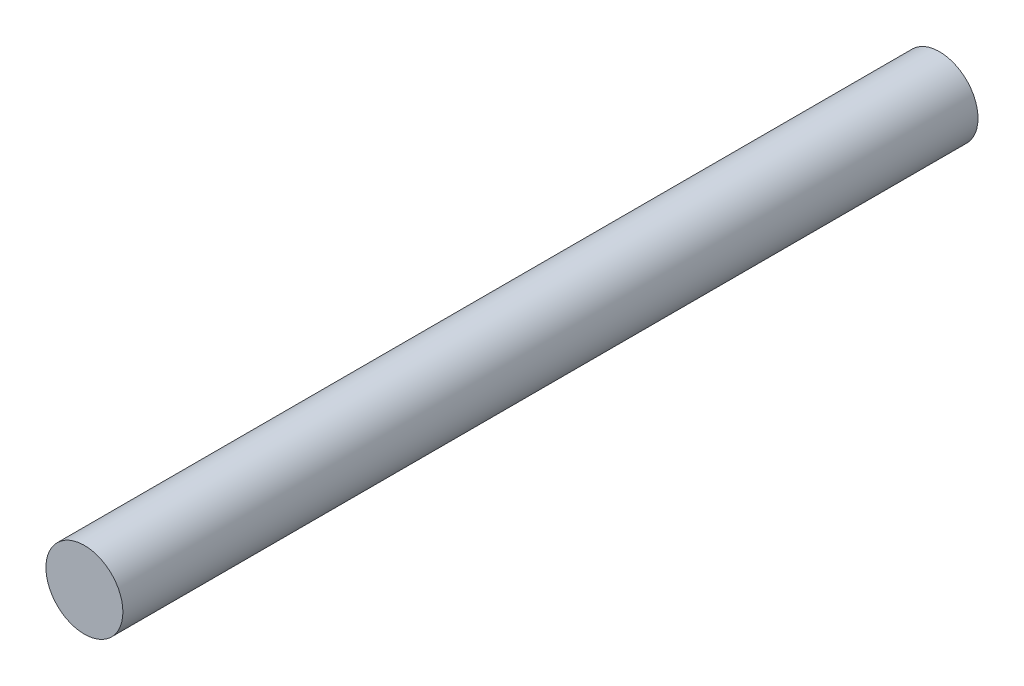
ISO-10303-21;
HEADER;
FILE_DESCRIPTION(('STEP AP214'),'2;1');
FILE_NAME('part.step','',(''),(''),'','','');
FILE_SCHEMA(('AUTOMOTIVE_DESIGN { 1 0 10303 214 1 1 1 1 }'));
ENDSEC;
DATA;
#1=APPLICATION_CONTEXT('core data for automotive mechanical design processes');
#2=APPLICATION_PROTOCOL_DEFINITION('international standard','automotive_design',2000,#1);
#3=PRODUCT_CONTEXT('',#1,'mechanical');
#4=PRODUCT('Part','Part','',(#3));
#5=PRODUCT_RELATED_PRODUCT_CATEGORY('part','',(#4));
#6=PRODUCT_DEFINITION_FORMATION('','',#4);
#7=PRODUCT_DEFINITION_CONTEXT('part definition',#1,'design');
#8=PRODUCT_DEFINITION('design','',#6,#7);
#9=PRODUCT_DEFINITION_SHAPE('','',#8);
#10=(LENGTH_UNIT() NAMED_UNIT(*) SI_UNIT(.MILLI.,.METRE.));
#11=(NAMED_UNIT(*) PLANE_ANGLE_UNIT() SI_UNIT($,.RADIAN.));
#12=(NAMED_UNIT(*) SI_UNIT($,.STERADIAN.) SOLID_ANGLE_UNIT());
#13=UNCERTAINTY_MEASURE_WITH_UNIT(LENGTH_MEASURE(1.E-05),#10,'distance_accuracy_value','');
#14=(GEOMETRIC_REPRESENTATION_CONTEXT(3) GLOBAL_UNCERTAINTY_ASSIGNED_CONTEXT((#13)) GLOBAL_UNIT_ASSIGNED_CONTEXT((#10,
#11,#12)) REPRESENTATION_CONTEXT('',''));
#15=CARTESIAN_POINT('',(0.,0.,0.));
#16=DIRECTION('',(0.,0.,1.));
#17=DIRECTION('',(1.,0.,0.));
#18=AXIS2_PLACEMENT_3D('',#15,#16,#17);
#19=CARTESIAN_POINT('',(0.,0.,20.));
#20=DIRECTION('',(0.,0.,-1.));
#21=DIRECTION('',(-1.,0.,0.));
#22=AXIS2_PLACEMENT_3D('',#19,#20,#21);
#23=CYLINDRICAL_SURFACE('',#22,1.8);
#24=CARTESIAN_POINT('',(0.,0.,20.));
#25=DIRECTION('',(0.,0.,1.));
#26=DIRECTION('',(1.,0.,0.));
#27=AXIS2_PLACEMENT_3D('',#24,#25,#26);
#28=CIRCLE('',#27,1.8);
#29=CARTESIAN_POINT('',(1.8,0.,20.));
#30=VERTEX_POINT('',#29);
#31=EDGE_CURVE('E10',#30,#30,#28,.T.);
#32=ORIENTED_EDGE('',*,*,#31,.F.);
#33=EDGE_LOOP('',(#32));
#34=FACE_BOUND('',#33,.T.);
#35=CARTESIAN_POINT('',(0.,0.,-20.));
#36=DIRECTION('',(0.,0.,1.));
#37=DIRECTION('',(1.,0.,0.));
#38=AXIS2_PLACEMENT_3D('',#35,#36,#37);
#39=CIRCLE('',#38,1.8);
#40=CARTESIAN_POINT('',(1.8,0.,-20.));
#41=VERTEX_POINT('',#40);
#42=EDGE_CURVE('E34',#41,#41,#39,.T.);
#43=ORIENTED_EDGE('',*,*,#42,.T.);
#44=EDGE_LOOP('',(#43));
#45=FACE_BOUND('',#44,.T.);
#46=ADVANCED_FACE('F31',(#34,#45),#23,.T.);
#47=CARTESIAN_POINT('',(0.,0.,20.));
#48=DIRECTION('',(0.,0.,1.));
#49=DIRECTION('',(1.,0.,0.));
#50=AXIS2_PLACEMENT_3D('',#47,#48,#49);
#51=PLANE('',#50);
#52=ORIENTED_EDGE('',*,*,#31,.T.);
#53=EDGE_LOOP('',(#52));
#54=FACE_BOUND('',#53,.T.);
#55=ADVANCED_FACE('F46',(#54),#51,.T.);
#56=CARTESIAN_POINT('',(0.,0.,-20.));
#57=DIRECTION('',(0.,0.,1.));
#58=DIRECTION('',(1.,0.,0.));
#59=AXIS2_PLACEMENT_3D('',#56,#57,#58);
#60=PLANE('',#59);
#61=ORIENTED_EDGE('',*,*,#42,.F.);
#62=EDGE_LOOP('',(#61));
#63=FACE_BOUND('',#62,.T.);
#64=ADVANCED_FACE('F44',(#63),#60,.F.);
#65=CLOSED_SHELL('',(#46,#55,#64));
#66=MANIFOLD_SOLID_BREP('B2',#65);
#67=ADVANCED_BREP_SHAPE_REPRESENTATION('',(#18,#66),#14);
#68=SHAPE_DEFINITION_REPRESENTATION(#9,#67);
ENDSEC;
END-ISO-10303-21;
